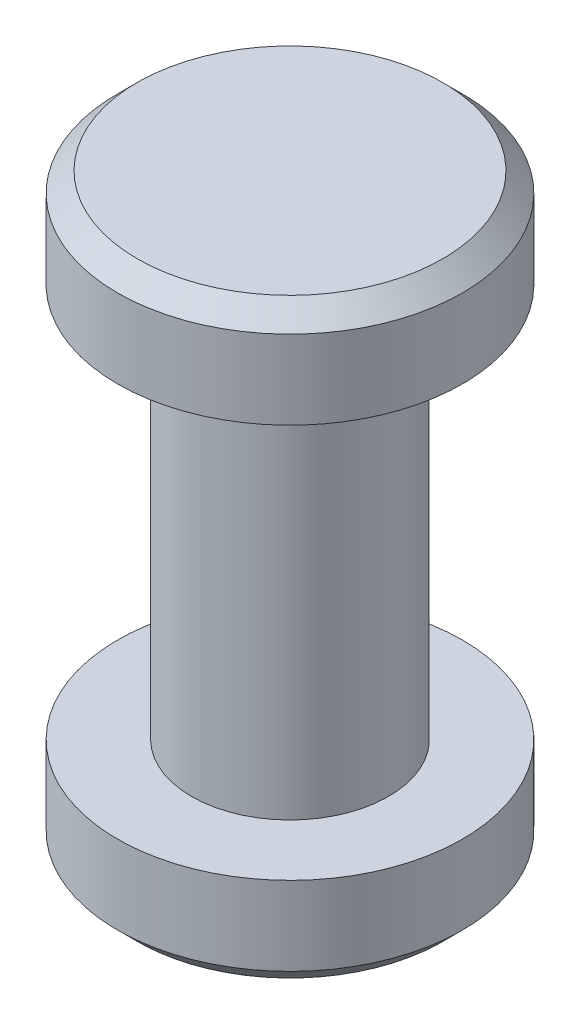
ISO-10303-21;
HEADER;
FILE_DESCRIPTION(('STEP AP214'),'2;1');
FILE_NAME('part.step','',(''),(''),'','','');
FILE_SCHEMA(('AUTOMOTIVE_DESIGN { 1 0 10303 214 1 1 1 1 }'));
ENDSEC;
DATA;
#1=APPLICATION_CONTEXT('core data for automotive mechanical design processes');
#2=APPLICATION_PROTOCOL_DEFINITION('international standard','automotive_design',2000,#1);
#3=PRODUCT_CONTEXT('',#1,'mechanical');
#4=PRODUCT('Part','Part','',(#3));
#5=PRODUCT_RELATED_PRODUCT_CATEGORY('part','',(#4));
#6=PRODUCT_DEFINITION_FORMATION('','',#4);
#7=PRODUCT_DEFINITION_CONTEXT('part definition',#1,'design');
#8=PRODUCT_DEFINITION('design','',#6,#7);
#9=PRODUCT_DEFINITION_SHAPE('','',#8);
#10=(LENGTH_UNIT() NAMED_UNIT(*) SI_UNIT(.MILLI.,.METRE.));
#11=(NAMED_UNIT(*) PLANE_ANGLE_UNIT() SI_UNIT($,.RADIAN.));
#12=(NAMED_UNIT(*) SI_UNIT($,.STERADIAN.) SOLID_ANGLE_UNIT());
#13=UNCERTAINTY_MEASURE_WITH_UNIT(LENGTH_MEASURE(1.E-05),#10,'distance_accuracy_value','');
#14=(GEOMETRIC_REPRESENTATION_CONTEXT(3) GLOBAL_UNCERTAINTY_ASSIGNED_CONTEXT((#13)) GLOBAL_UNIT_ASSIGNED_CONTEXT((#10,
#11,#12)) REPRESENTATION_CONTEXT('',''));
#15=CARTESIAN_POINT('',(0.,0.,0.));
#16=DIRECTION('',(0.,0.,1.));
#17=DIRECTION('',(1.,0.,0.));
#18=AXIS2_PLACEMENT_3D('',#15,#16,#17);
#19=CARTESIAN_POINT('',(0.,4.,0.));
#20=DIRECTION('',(0.,-1.,0.));
#21=DIRECTION('',(0.,0.,-1.));
#22=AXIS2_PLACEMENT_3D('',#19,#20,#21);
#23=CYLINDRICAL_SURFACE('',#22,1.);
#24=CARTESIAN_POINT('',(0.,4.,0.));
#25=DIRECTION('',(0.,1.,0.));
#26=DIRECTION('',(0.,0.,1.));
#27=AXIS2_PLACEMENT_3D('',#24,#25,#26);
#28=CIRCLE('',#27,1.);
#29=CARTESIAN_POINT('',(0.,4.,1.));
#30=VERTEX_POINT('',#29);
#31=EDGE_CURVE('E57',#30,#30,#28,.T.);
#32=ORIENTED_EDGE('',*,*,#31,.F.);
#33=EDGE_LOOP('',(#32));
#34=FACE_BOUND('',#33,.T.);
#35=CARTESIAN_POINT('',(0.,0.,0.));
#36=DIRECTION('',(0.,1.,0.));
#37=DIRECTION('',(0.,0.,1.));
#38=AXIS2_PLACEMENT_3D('',#35,#36,#37);
#39=CIRCLE('',#38,1.);
#40=CARTESIAN_POINT('',(0.,0.,1.));
#41=VERTEX_POINT('',#40);
#42=EDGE_CURVE('E58',#41,#41,#39,.T.);
#43=ORIENTED_EDGE('',*,*,#42,.T.);
#44=EDGE_LOOP('',(#43));
#45=FACE_BOUND('',#44,.T.);
#46=ADVANCED_FACE('F36',(#34,#45),#23,.T.);
#47=CARTESIAN_POINT('',(0.,5.,0.));
#48=DIRECTION('',(0.,-1.,0.));
#49=DIRECTION('',(0.,0.,-1.));
#50=AXIS2_PLACEMENT_3D('',#47,#48,#49);
#51=CYLINDRICAL_SURFACE('',#50,1.75);
#52=CARTESIAN_POINT('',(0.,4.8,0.));
#53=DIRECTION('',(0.,1.,0.));
#54=DIRECTION('',(0.,0.,1.));
#55=AXIS2_PLACEMENT_3D('',#52,#53,#54);
#56=CIRCLE('',#55,1.75);
#57=CARTESIAN_POINT('',(0.,4.8,1.75));
#58=VERTEX_POINT('',#57);
#59=EDGE_CURVE('E48',#58,#58,#56,.F.);
#60=ORIENTED_EDGE('',*,*,#59,.T.);
#61=EDGE_LOOP('',(#60));
#62=FACE_BOUND('',#61,.T.);
#63=CARTESIAN_POINT('',(0.,4.,0.));
#64=DIRECTION('',(0.,1.,0.));
#65=DIRECTION('',(0.,0.,1.));
#66=AXIS2_PLACEMENT_3D('',#63,#64,#65);
#67=CIRCLE('',#66,1.75);
#68=CARTESIAN_POINT('',(0.,4.,1.75));
#69=VERTEX_POINT('',#68);
#70=EDGE_CURVE('E61',#69,#69,#67,.T.);
#71=ORIENTED_EDGE('',*,*,#70,.T.);
#72=EDGE_LOOP('',(#71));
#73=FACE_BOUND('',#72,.T.);
#74=ADVANCED_FACE('F86',(#62,#73),#51,.T.);
#75=CARTESIAN_POINT('',(0.,5.,0.));
#76=DIRECTION('',(0.,1.,0.));
#77=DIRECTION('',(0.,0.,1.));
#78=AXIS2_PLACEMENT_3D('',#75,#76,#77);
#79=PLANE('',#78);
#80=CARTESIAN_POINT('',(0.,5.,0.));
#81=DIRECTION('',(0.,1.,0.));
#82=DIRECTION('',(0.,0.,1.));
#83=AXIS2_PLACEMENT_3D('',#80,#81,#82);
#84=CIRCLE('',#83,1.55);
#85=CARTESIAN_POINT('',(0.,5.,1.55));
#86=VERTEX_POINT('',#85);
#87=EDGE_CURVE('E52',#86,#86,#84,.T.);
#88=ORIENTED_EDGE('',*,*,#87,.T.);
#89=EDGE_LOOP('',(#88));
#90=FACE_BOUND('',#89,.T.);
#91=ADVANCED_FACE('F92',(#90),#79,.T.);
#92=CARTESIAN_POINT('',(0.,4.,0.));
#93=DIRECTION('',(0.,1.,0.));
#94=DIRECTION('',(0.,0.,1.));
#95=AXIS2_PLACEMENT_3D('',#92,#93,#94);
#96=PLANE('',#95);
#97=ORIENTED_EDGE('',*,*,#31,.T.);
#98=EDGE_LOOP('',(#97));
#99=FACE_BOUND('',#98,.T.);
#100=ORIENTED_EDGE('',*,*,#70,.F.);
#101=EDGE_LOOP('',(#100));
#102=FACE_BOUND('',#101,.T.);
#103=ADVANCED_FACE('F103',(#99,#102),#96,.F.);
#104=CARTESIAN_POINT('',(0.,5.,0.));
#105=DIRECTION('',(0.,-1.,0.));
#106=DIRECTION('',(0.,0.,-1.));
#107=AXIS2_PLACEMENT_3D('',#104,#105,#106);
#108=CONICAL_SURFACE('',#107,1.55,0.785398163397447);
#109=ORIENTED_EDGE('',*,*,#59,.F.);
#110=EDGE_LOOP('',(#109));
#111=FACE_BOUND('',#110,.T.);
#112=ORIENTED_EDGE('',*,*,#87,.F.);
#113=EDGE_LOOP('',(#112));
#114=FACE_BOUND('',#113,.T.);
#115=ADVANCED_FACE('F99',(#111,#114),#108,.T.);
#116=CARTESIAN_POINT('',(0.,-1.,0.));
#117=DIRECTION('',(0.,1.,0.));
#118=DIRECTION('',(0.,0.,1.));
#119=AXIS2_PLACEMENT_3D('',#116,#117,#118);
#120=CYLINDRICAL_SURFACE('',#119,1.75);
#121=CARTESIAN_POINT('',(0.,-0.8,0.));
#122=DIRECTION('',(0.,-1.,0.));
#123=DIRECTION('',(0.,0.,-1.));
#124=AXIS2_PLACEMENT_3D('',#121,#122,#123);
#125=CIRCLE('',#124,1.75);
#126=CARTESIAN_POINT('',(0.,-0.8,-1.75));
#127=VERTEX_POINT('',#126);
#128=EDGE_CURVE('E10',#127,#127,#125,.F.);
#129=ORIENTED_EDGE('',*,*,#128,.T.);
#130=EDGE_LOOP('',(#129));
#131=FACE_BOUND('',#130,.T.);
#132=CARTESIAN_POINT('',(0.,0.,0.));
#133=DIRECTION('',(0.,-1.,0.));
#134=DIRECTION('',(0.,0.,-1.));
#135=AXIS2_PLACEMENT_3D('',#132,#133,#134);
#136=CIRCLE('',#135,1.75);
#137=CARTESIAN_POINT('',(0.,0.,-1.75));
#138=VERTEX_POINT('',#137);
#139=EDGE_CURVE('E62',#138,#138,#136,.T.);
#140=ORIENTED_EDGE('',*,*,#139,.T.);
#141=EDGE_LOOP('',(#140));
#142=FACE_BOUND('',#141,.T.);
#143=ADVANCED_FACE('F70',(#131,#142),#120,.T.);
#144=CARTESIAN_POINT('',(0.,-1.,0.));
#145=DIRECTION('',(0.,-1.,0.));
#146=DIRECTION('',(0.,0.,-1.));
#147=AXIS2_PLACEMENT_3D('',#144,#145,#146);
#148=PLANE('',#147);
#149=CARTESIAN_POINT('',(0.,-1.,0.));
#150=DIRECTION('',(0.,-1.,0.));
#151=DIRECTION('',(0.,0.,-1.));
#152=AXIS2_PLACEMENT_3D('',#149,#150,#151);
#153=CIRCLE('',#152,1.55);
#154=CARTESIAN_POINT('',(0.,-1.,-1.55));
#155=VERTEX_POINT('',#154);
#156=EDGE_CURVE('E44',#155,#155,#153,.T.);
#157=ORIENTED_EDGE('',*,*,#156,.T.);
#158=EDGE_LOOP('',(#157));
#159=FACE_BOUND('',#158,.T.);
#160=ADVANCED_FACE('F74',(#159),#148,.T.);
#161=CARTESIAN_POINT('',(0.,0.,0.));
#162=DIRECTION('',(0.,-1.,0.));
#163=DIRECTION('',(0.,0.,-1.));
#164=AXIS2_PLACEMENT_3D('',#161,#162,#163);
#165=PLANE('',#164);
#166=ORIENTED_EDGE('',*,*,#42,.F.);
#167=EDGE_LOOP('',(#166));
#168=FACE_BOUND('',#167,.T.);
#169=ORIENTED_EDGE('',*,*,#139,.F.);
#170=EDGE_LOOP('',(#169));
#171=FACE_BOUND('',#170,.T.);
#172=ADVANCED_FACE('F72',(#168,#171),#165,.F.);
#173=CARTESIAN_POINT('',(0.,-1.,0.));
#174=DIRECTION('',(0.,1.,0.));
#175=DIRECTION('',(0.,0.,1.));
#176=AXIS2_PLACEMENT_3D('',#173,#174,#175);
#177=CONICAL_SURFACE('',#176,1.55,0.785398163397446);
#178=ORIENTED_EDGE('',*,*,#128,.F.);
#179=EDGE_LOOP('',(#178));
#180=FACE_BOUND('',#179,.T.);
#181=ORIENTED_EDGE('',*,*,#156,.F.);
#182=EDGE_LOOP('',(#181));
#183=FACE_BOUND('',#182,.T.);
#184=ADVANCED_FACE('F39',(#180,#183),#177,.T.);
#185=CLOSED_SHELL('',(#46,#74,#91,#103,#115,#143,#160,#172,#184));
#186=MANIFOLD_SOLID_BREP('B2',#185);
#187=ADVANCED_BREP_SHAPE_REPRESENTATION('',(#18,#186),#14);
#188=SHAPE_DEFINITION_REPRESENTATION(#9,#187);
ENDSEC;
END-ISO-10303-21;
